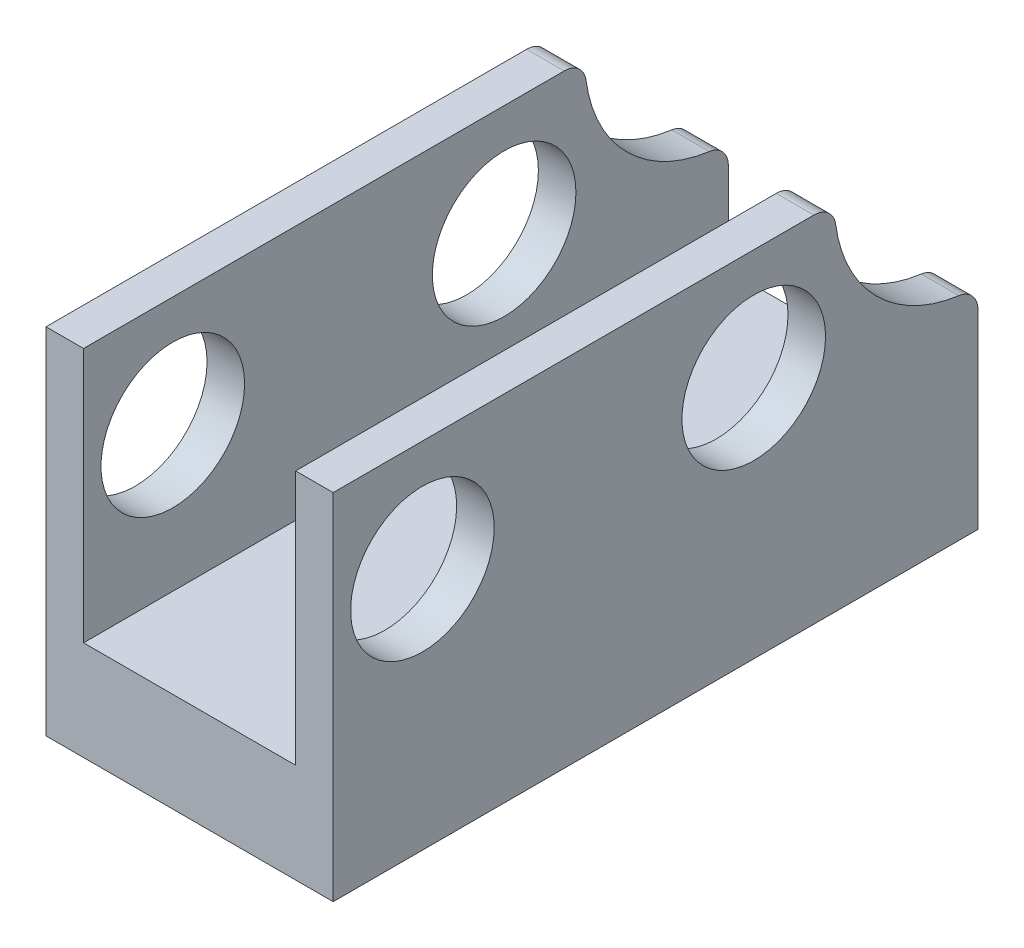
ISO-10303-21;
HEADER;
FILE_DESCRIPTION(('STEP AP214'),'2;1');
FILE_NAME('part.step','',(''),(''),'','','');
FILE_SCHEMA(('AUTOMOTIVE_DESIGN { 1 0 10303 214 1 1 1 1 }'));
ENDSEC;
DATA;
#1=APPLICATION_CONTEXT('core data for automotive mechanical design processes');
#2=APPLICATION_PROTOCOL_DEFINITION('international standard','automotive_design',2000,#1);
#3=PRODUCT_CONTEXT('',#1,'mechanical');
#4=PRODUCT('Part','Part','',(#3));
#5=PRODUCT_RELATED_PRODUCT_CATEGORY('part','',(#4));
#6=PRODUCT_DEFINITION_FORMATION('','',#4);
#7=PRODUCT_DEFINITION_CONTEXT('part definition',#1,'design');
#8=PRODUCT_DEFINITION('design','',#6,#7);
#9=PRODUCT_DEFINITION_SHAPE('','',#8);
#10=(LENGTH_UNIT() NAMED_UNIT(*) SI_UNIT(.MILLI.,.METRE.));
#11=(NAMED_UNIT(*) PLANE_ANGLE_UNIT() SI_UNIT($,.RADIAN.));
#12=(NAMED_UNIT(*) SI_UNIT($,.STERADIAN.) SOLID_ANGLE_UNIT());
#13=UNCERTAINTY_MEASURE_WITH_UNIT(LENGTH_MEASURE(1.E-05),#10,'distance_accuracy_value','');
#14=(GEOMETRIC_REPRESENTATION_CONTEXT(3) GLOBAL_UNCERTAINTY_ASSIGNED_CONTEXT((#13)) GLOBAL_UNIT_ASSIGNED_CONTEXT((#10,
#11,#12)) REPRESENTATION_CONTEXT('',''));
#15=CARTESIAN_POINT('',(0.,0.,0.));
#16=DIRECTION('',(0.,0.,1.));
#17=DIRECTION('',(1.,0.,0.));
#18=AXIS2_PLACEMENT_3D('',#15,#16,#17);
#19=CARTESIAN_POINT('',(3.25,4.01,7.297811695));
#20=DIRECTION('',(0.,0.,-1.));
#21=DIRECTION('',(-1.,0.,0.));
#22=AXIS2_PLACEMENT_3D('',#19,#20,#21);
#23=PLANE('',#22);
#24=DIRECTION('',(0.,-1.,0.));
#25=VECTOR('',#24,1.);
#26=CARTESIAN_POINT('',(-2.4,4.01,7.297811695));
#27=LINE('',#26,#25);
#28=CARTESIAN_POINT('',(-2.4,4.01,7.297811695));
#29=VERTEX_POINT('',#28);
#30=CARTESIAN_POINT('',(-2.4,-1.76,7.297811695));
#31=VERTEX_POINT('',#30);
#32=EDGE_CURVE('E162',#29,#31,#27,.T.);
#33=ORIENTED_EDGE('',*,*,#32,.F.);
#34=DIRECTION('',(-1.,0.,0.));
#35=VECTOR('',#34,1.);
#36=CARTESIAN_POINT('',(3.25,4.01,7.297811695));
#37=LINE('',#36,#35);
#38=CARTESIAN_POINT('',(-3.25,4.01,7.297811695));
#39=VERTEX_POINT('',#38);
#40=EDGE_CURVE('E214',#29,#39,#37,.T.);
#41=ORIENTED_EDGE('',*,*,#40,.T.);
#42=DIRECTION('',(0.,-1.,0.));
#43=VECTOR('',#42,1.);
#44=CARTESIAN_POINT('',(-3.25,4.01,7.297811695));
#45=LINE('',#44,#43);
#46=CARTESIAN_POINT('',(-3.25,-4.01,7.297811695));
#47=VERTEX_POINT('',#46);
#48=EDGE_CURVE('E200',#39,#47,#45,.T.);
#49=ORIENTED_EDGE('',*,*,#48,.T.);
#50=DIRECTION('',(-1.,0.,0.));
#51=VECTOR('',#50,1.);
#52=CARTESIAN_POINT('',(3.25,-4.01,7.297811695));
#53=LINE('',#52,#51);
#54=CARTESIAN_POINT('',(3.25,-4.01,7.297811695));
#55=VERTEX_POINT('',#54);
#56=EDGE_CURVE('E228',#55,#47,#53,.T.);
#57=ORIENTED_EDGE('',*,*,#56,.F.);
#58=DIRECTION('',(0.,-1.,0.));
#59=VECTOR('',#58,1.);
#60=CARTESIAN_POINT('',(3.25,4.01,7.297811695));
#61=LINE('',#60,#59);
#62=CARTESIAN_POINT('',(3.25,4.01,7.297811695));
#63=VERTEX_POINT('',#62);
#64=EDGE_CURVE('E203',#63,#55,#61,.T.);
#65=ORIENTED_EDGE('',*,*,#64,.F.);
#66=CARTESIAN_POINT('',(2.4,4.01,7.297811695));
#67=VERTEX_POINT('',#66);
#68=EDGE_CURVE('E223',#63,#67,#37,.T.);
#69=ORIENTED_EDGE('',*,*,#68,.T.);
#70=DIRECTION('',(0.,-1.,0.));
#71=VECTOR('',#70,1.);
#72=CARTESIAN_POINT('',(2.4,4.01,7.297811695));
#73=LINE('',#72,#71);
#74=CARTESIAN_POINT('',(2.4,-1.76,7.297811695));
#75=VERTEX_POINT('',#74);
#76=EDGE_CURVE('E176',#67,#75,#73,.T.);
#77=ORIENTED_EDGE('',*,*,#76,.T.);
#78=DIRECTION('',(1.,0.,0.));
#79=VECTOR('',#78,1.);
#80=CARTESIAN_POINT('',(-2.4,-1.76,7.297811695));
#81=LINE('',#80,#79);
#82=EDGE_CURVE('E154',#31,#75,#81,.T.);
#83=ORIENTED_EDGE('',*,*,#82,.F.);
#84=EDGE_LOOP('',(#33,#41,#49,#57,#65,#69,#77,#83));
#85=FACE_BOUND('',#84,.T.);
#86=ADVANCED_FACE('F48',(#85),#23,.F.);
#87=CARTESIAN_POINT('',(3.25,4.01,-7.297811695));
#88=DIRECTION('',(0.,0.,1.));
#89=DIRECTION('',(1.,0.,0.));
#90=AXIS2_PLACEMENT_3D('',#87,#88,#89);
#91=PLANE('',#90);
#92=DIRECTION('',(0.,1.,0.));
#93=VECTOR('',#92,1.);
#94=CARTESIAN_POINT('',(2.4,4.01,-7.297811695));
#95=LINE('',#94,#93);
#96=CARTESIAN_POINT('',(2.4,-1.76,-7.297811695));
#97=VERTEX_POINT('',#96);
#98=CARTESIAN_POINT('',(2.4,0.293482813170374,-7.297811695));
#99=VERTEX_POINT('',#98);
#100=EDGE_CURVE('E295',#97,#99,#95,.T.);
#101=ORIENTED_EDGE('',*,*,#100,.T.);
#102=DIRECTION('',(1.,0.,0.));
#103=VECTOR('',#102,1.);
#104=CARTESIAN_POINT('',(3.25,0.293482813170374,-7.297811695));
#105=LINE('',#104,#103);
#106=CARTESIAN_POINT('',(3.25,0.293482813170374,-7.297811695));
#107=VERTEX_POINT('',#106);
#108=EDGE_CURVE('E241',#99,#107,#105,.T.);
#109=ORIENTED_EDGE('',*,*,#108,.T.);
#110=DIRECTION('',(0.,1.,0.));
#111=VECTOR('',#110,1.);
#112=CARTESIAN_POINT('',(3.25,4.01,-7.297811695));
#113=LINE('',#112,#111);
#114=CARTESIAN_POINT('',(3.25,-4.01,-7.297811695));
#115=VERTEX_POINT('',#114);
#116=EDGE_CURVE('E209',#115,#107,#113,.T.);
#117=ORIENTED_EDGE('',*,*,#116,.F.);
#118=DIRECTION('',(-1.,0.,0.));
#119=VECTOR('',#118,1.);
#120=CARTESIAN_POINT('',(3.25,-4.01,-7.297811695));
#121=LINE('',#120,#119);
#122=CARTESIAN_POINT('',(-3.25,-4.01,-7.297811695));
#123=VERTEX_POINT('',#122);
#124=EDGE_CURVE('E225',#115,#123,#121,.T.);
#125=ORIENTED_EDGE('',*,*,#124,.T.);
#126=DIRECTION('',(0.,1.,0.));
#127=VECTOR('',#126,1.);
#128=CARTESIAN_POINT('',(-3.25,4.01,-7.297811695));
#129=LINE('',#128,#127);
#130=CARTESIAN_POINT('',(-3.25,0.293482813170374,-7.297811695));
#131=VERTEX_POINT('',#130);
#132=EDGE_CURVE('E219',#123,#131,#129,.T.);
#133=ORIENTED_EDGE('',*,*,#132,.T.);
#134=DIRECTION('',(1.,0.,0.));
#135=VECTOR('',#134,1.);
#136=CARTESIAN_POINT('',(3.25,0.293482813170374,-7.297811695));
#137=LINE('',#136,#135);
#138=CARTESIAN_POINT('',(-2.4,0.293482813170374,-7.297811695));
#139=VERTEX_POINT('',#138);
#140=EDGE_CURVE('E238',#131,#139,#137,.T.);
#141=ORIENTED_EDGE('',*,*,#140,.T.);
#142=DIRECTION('',(0.,1.,0.));
#143=VECTOR('',#142,1.);
#144=CARTESIAN_POINT('',(-2.4,4.01,-7.297811695));
#145=LINE('',#144,#143);
#146=CARTESIAN_POINT('',(-2.4,-1.76,-7.297811695));
#147=VERTEX_POINT('',#146);
#148=EDGE_CURVE('E161',#147,#139,#145,.T.);
#149=ORIENTED_EDGE('',*,*,#148,.F.);
#150=DIRECTION('',(1.,0.,0.));
#151=VECTOR('',#150,1.);
#152=CARTESIAN_POINT('',(-2.4,-1.76,-7.297811695));
#153=LINE('',#152,#151);
#154=EDGE_CURVE('E157',#147,#97,#153,.T.);
#155=ORIENTED_EDGE('',*,*,#154,.T.);
#156=EDGE_LOOP('',(#101,#109,#117,#125,#133,#141,#149,#155));
#157=FACE_BOUND('',#156,.T.);
#158=ADVANCED_FACE('F278',(#157),#91,.F.);
#159=CARTESIAN_POINT('',(3.25,4.01,7.297811695));
#160=DIRECTION('',(0.,-1.,0.));
#161=DIRECTION('',(0.,0.,-1.));
#162=AXIS2_PLACEMENT_3D('',#159,#160,#161);
#163=PLANE('',#162);
#164=DIRECTION('',(0.,0.,1.));
#165=VECTOR('',#164,1.);
#166=CARTESIAN_POINT('',(-2.4,4.01,7.297811695));
#167=LINE('',#166,#165);
#168=CARTESIAN_POINT('',(-2.4,4.01,-3.58129450817037));
#169=VERTEX_POINT('',#168);
#170=EDGE_CURVE('E167',#169,#29,#167,.T.);
#171=ORIENTED_EDGE('',*,*,#170,.F.);
#172=DIRECTION('',(1.,0.,0.));
#173=VECTOR('',#172,1.);
#174=CARTESIAN_POINT('',(3.25,4.01,-3.58129450817037));
#175=LINE('',#174,#173);
#176=CARTESIAN_POINT('',(-3.25,4.01,-3.58129450817037));
#177=VERTEX_POINT('',#176);
#178=EDGE_CURVE('E13',#169,#177,#175,.F.);
#179=ORIENTED_EDGE('',*,*,#178,.T.);
#180=DIRECTION('',(0.,0.,1.));
#181=VECTOR('',#180,1.);
#182=CARTESIAN_POINT('',(-3.25,4.01,7.297811695));
#183=LINE('',#182,#181);
#184=EDGE_CURVE('E207',#177,#39,#183,.T.);
#185=ORIENTED_EDGE('',*,*,#184,.T.);
#186=ORIENTED_EDGE('',*,*,#40,.F.);
#187=EDGE_LOOP('',(#171,#179,#185,#186));
#188=FACE_BOUND('',#187,.T.);
#189=ADVANCED_FACE('F336',(#188),#163,.F.);
#190=CARTESIAN_POINT('',(3.25,1.5,5.277811695));
#191=DIRECTION('',(-1.,0.,0.));
#192=DIRECTION('',(0.,0.,1.));
#193=AXIS2_PLACEMENT_3D('',#190,#191,#192);
#194=CYLINDRICAL_SURFACE('',#193,1.625);
#195=CARTESIAN_POINT('',(-3.25,1.5,5.277811695));
#196=DIRECTION('',(1.,0.,0.));
#197=DIRECTION('',(0.,0.,-1.));
#198=AXIS2_PLACEMENT_3D('',#195,#196,#197);
#199=CIRCLE('',#198,1.625);
#200=CARTESIAN_POINT('',(-3.25,1.5,3.652811695));
#201=VERTEX_POINT('',#200);
#202=EDGE_CURVE('E194',#201,#201,#199,.T.);
#203=ORIENTED_EDGE('',*,*,#202,.F.);
#204=EDGE_LOOP('',(#203));
#205=FACE_BOUND('',#204,.T.);
#206=CARTESIAN_POINT('',(-2.4,1.5,5.277811695));
#207=DIRECTION('',(1.,0.,0.));
#208=DIRECTION('',(0.,0.,-1.));
#209=AXIS2_PLACEMENT_3D('',#206,#207,#208);
#210=CIRCLE('',#209,1.625);
#211=CARTESIAN_POINT('',(-2.4,1.5,3.652811695));
#212=VERTEX_POINT('',#211);
#213=EDGE_CURVE('E187',#212,#212,#210,.T.);
#214=ORIENTED_EDGE('',*,*,#213,.T.);
#215=EDGE_LOOP('',(#214));
#216=FACE_BOUND('',#215,.T.);
#217=ADVANCED_FACE('F355',(#205,#216),#194,.F.);
#218=CARTESIAN_POINT('',(3.25,1.5,-2.222188305));
#219=DIRECTION('',(-1.,0.,0.));
#220=DIRECTION('',(0.,0.,1.));
#221=AXIS2_PLACEMENT_3D('',#218,#219,#220);
#222=CYLINDRICAL_SURFACE('',#221,1.625);
#223=CARTESIAN_POINT('',(-3.25,1.5,-2.222188305));
#224=DIRECTION('',(1.,0.,0.));
#225=DIRECTION('',(0.,0.,-1.));
#226=AXIS2_PLACEMENT_3D('',#223,#224,#225);
#227=CIRCLE('',#226,1.625);
#228=CARTESIAN_POINT('',(-3.25,1.5,-3.847188305));
#229=VERTEX_POINT('',#228);
#230=EDGE_CURVE('E190',#229,#229,#227,.T.);
#231=ORIENTED_EDGE('',*,*,#230,.F.);
#232=EDGE_LOOP('',(#231));
#233=FACE_BOUND('',#232,.T.);
#234=CARTESIAN_POINT('',(-2.4,1.5,-2.222188305));
#235=DIRECTION('',(1.,0.,0.));
#236=DIRECTION('',(0.,0.,-1.));
#237=AXIS2_PLACEMENT_3D('',#234,#235,#236);
#238=CIRCLE('',#237,1.625);
#239=CARTESIAN_POINT('',(-2.4,1.5,-3.847188305));
#240=VERTEX_POINT('',#239);
#241=EDGE_CURVE('E186',#240,#240,#238,.T.);
#242=ORIENTED_EDGE('',*,*,#241,.T.);
#243=EDGE_LOOP('',(#242));
#244=FACE_BOUND('',#243,.T.);
#245=ADVANCED_FACE('F350',(#233,#244),#222,.F.);
#246=CARTESIAN_POINT('',(3.25,0.,0.));
#247=DIRECTION('',(1.,0.,0.));
#248=DIRECTION('',(0.,0.,-1.));
#249=AXIS2_PLACEMENT_3D('',#246,#247,#248);
#250=PLANE('',#249);
#251=ORIENTED_EDGE('',*,*,#116,.T.);
#252=CARTESIAN_POINT('',(3.25,0.293482813170374,-6.797811695));
#253=DIRECTION('',(1.,0.,0.));
#254=DIRECTION('',(0.,0.,-1.));
#255=AXIS2_PLACEMENT_3D('',#252,#253,#254);
#256=CIRCLE('',#255,0.5);
#257=CARTESIAN_POINT('',(3.25,0.78901843808099,-6.86447836166667));
#258=VERTEX_POINT('',#257);
#259=EDGE_CURVE('E246',#107,#258,#256,.T.);
#260=ORIENTED_EDGE('',*,*,#259,.T.);
#261=CARTESIAN_POINT('',(3.25,4.01,-7.297811695));
#262=DIRECTION('',(1.,0.,0.));
#263=DIRECTION('',(0.,0.,-1.));
#264=AXIS2_PLACEMENT_3D('',#261,#262,#263);
#265=CIRCLE('',#264,3.25);
#266=CARTESIAN_POINT('',(3.25,3.57666666666667,-4.07683013308099));
#267=VERTEX_POINT('',#266);
#268=EDGE_CURVE('E289',#267,#258,#265,.T.);
#269=ORIENTED_EDGE('',*,*,#268,.F.);
#270=CARTESIAN_POINT('',(3.25,3.51,-3.58129450817037));
#271=DIRECTION('',(1.,0.,0.));
#272=DIRECTION('',(0.,0.,-1.));
#273=AXIS2_PLACEMENT_3D('',#270,#271,#272);
#274=CIRCLE('',#273,0.5);
#275=CARTESIAN_POINT('',(3.25,4.01,-3.58129450817037));
#276=VERTEX_POINT('',#275);
#277=EDGE_CURVE('E244',#267,#276,#274,.T.);
#278=ORIENTED_EDGE('',*,*,#277,.T.);
#279=DIRECTION('',(0.,0.,1.));
#280=VECTOR('',#279,1.);
#281=CARTESIAN_POINT('',(3.25,4.01,7.297811695));
#282=LINE('',#281,#280);
#283=EDGE_CURVE('E212',#276,#63,#282,.T.);
#284=ORIENTED_EDGE('',*,*,#283,.T.);
#285=ORIENTED_EDGE('',*,*,#64,.T.);
#286=DIRECTION('',(0.,0.,-1.));
#287=VECTOR('',#286,1.);
#288=CARTESIAN_POINT('',(3.25,-4.01,7.297811695));
#289=LINE('',#288,#287);
#290=EDGE_CURVE('E206',#55,#115,#289,.T.);
#291=ORIENTED_EDGE('',*,*,#290,.T.);
#292=EDGE_LOOP('',(#251,#260,#269,#278,#284,#285,#291));
#293=FACE_BOUND('',#292,.T.);
#294=CARTESIAN_POINT('',(3.25,1.5,5.277811695));
#295=DIRECTION('',(1.,0.,0.));
#296=DIRECTION('',(0.,0.,-1.));
#297=AXIS2_PLACEMENT_3D('',#294,#295,#296);
#298=CIRCLE('',#297,1.625);
#299=CARTESIAN_POINT('',(3.25,1.5,3.652811695));
#300=VERTEX_POINT('',#299);
#301=EDGE_CURVE('E197',#300,#300,#298,.T.);
#302=ORIENTED_EDGE('',*,*,#301,.F.);
#303=EDGE_LOOP('',(#302));
#304=FACE_BOUND('',#303,.T.);
#305=CARTESIAN_POINT('',(3.25,1.5,-2.222188305));
#306=DIRECTION('',(1.,0.,0.));
#307=DIRECTION('',(0.,0.,-1.));
#308=AXIS2_PLACEMENT_3D('',#305,#306,#307);
#309=CIRCLE('',#308,1.625);
#310=CARTESIAN_POINT('',(3.25,1.5,-3.847188305));
#311=VERTEX_POINT('',#310);
#312=EDGE_CURVE('E191',#311,#311,#309,.T.);
#313=ORIENTED_EDGE('',*,*,#312,.F.);
#314=EDGE_LOOP('',(#313));
#315=FACE_BOUND('',#314,.T.);
#316=ADVANCED_FACE('F308',(#293,#304,#315),#250,.T.);
#317=CARTESIAN_POINT('',(-3.25,0.,0.));
#318=DIRECTION('',(1.,0.,0.));
#319=DIRECTION('',(0.,0.,-1.));
#320=AXIS2_PLACEMENT_3D('',#317,#318,#319);
#321=PLANE('',#320);
#322=CARTESIAN_POINT('',(-3.25,4.01,-7.297811695));
#323=DIRECTION('',(1.,0.,0.));
#324=DIRECTION('',(0.,0.,-1.));
#325=AXIS2_PLACEMENT_3D('',#322,#323,#324);
#326=CIRCLE('',#325,3.25);
#327=CARTESIAN_POINT('',(-3.25,3.57666666666667,-4.07683013308099));
#328=VERTEX_POINT('',#327);
#329=CARTESIAN_POINT('',(-3.25,0.78901843808099,-6.86447836166667));
#330=VERTEX_POINT('',#329);
#331=EDGE_CURVE('E273',#328,#330,#326,.T.);
#332=ORIENTED_EDGE('',*,*,#331,.T.);
#333=CARTESIAN_POINT('',(-3.25,0.293482813170374,-6.797811695));
#334=DIRECTION('',(1.,0.,0.));
#335=DIRECTION('',(0.,0.,-1.));
#336=AXIS2_PLACEMENT_3D('',#333,#334,#335);
#337=CIRCLE('',#336,0.5);
#338=EDGE_CURVE('E56',#330,#131,#337,.F.);
#339=ORIENTED_EDGE('',*,*,#338,.T.);
#340=ORIENTED_EDGE('',*,*,#132,.F.);
#341=DIRECTION('',(0.,0.,-1.));
#342=VECTOR('',#341,1.);
#343=CARTESIAN_POINT('',(-3.25,-4.01,7.297811695));
#344=LINE('',#343,#342);
#345=EDGE_CURVE('E217',#47,#123,#344,.T.);
#346=ORIENTED_EDGE('',*,*,#345,.F.);
#347=ORIENTED_EDGE('',*,*,#48,.F.);
#348=ORIENTED_EDGE('',*,*,#184,.F.);
#349=CARTESIAN_POINT('',(-3.25,3.51,-3.58129450817037));
#350=DIRECTION('',(1.,0.,0.));
#351=DIRECTION('',(0.,0.,-1.));
#352=AXIS2_PLACEMENT_3D('',#349,#350,#351);
#353=CIRCLE('',#352,0.5);
#354=EDGE_CURVE('E267',#177,#328,#353,.F.);
#355=ORIENTED_EDGE('',*,*,#354,.T.);
#356=EDGE_LOOP('',(#332,#339,#340,#346,#347,#348,#355));
#357=FACE_BOUND('',#356,.T.);
#358=ORIENTED_EDGE('',*,*,#202,.T.);
#359=EDGE_LOOP('',(#358));
#360=FACE_BOUND('',#359,.T.);
#361=ORIENTED_EDGE('',*,*,#230,.T.);
#362=EDGE_LOOP('',(#361));
#363=FACE_BOUND('',#362,.T.);
#364=ADVANCED_FACE('F271',(#357,#360,#363),#321,.F.);
#365=CARTESIAN_POINT('',(3.25,-4.01,7.297811695));
#366=DIRECTION('',(0.,1.,0.));
#367=DIRECTION('',(0.,0.,1.));
#368=AXIS2_PLACEMENT_3D('',#365,#366,#367);
#369=PLANE('',#368);
#370=ORIENTED_EDGE('',*,*,#345,.T.);
#371=ORIENTED_EDGE('',*,*,#124,.F.);
#372=ORIENTED_EDGE('',*,*,#290,.F.);
#373=ORIENTED_EDGE('',*,*,#56,.T.);
#374=EDGE_LOOP('',(#370,#371,#372,#373));
#375=FACE_BOUND('',#374,.T.);
#376=ADVANCED_FACE('F339',(#375),#369,.F.);
#377=ORIENTED_EDGE('',*,*,#283,.F.);
#378=DIRECTION('',(1.,0.,0.));
#379=VECTOR('',#378,1.);
#380=CARTESIAN_POINT('',(3.25,4.01,-3.58129450817037));
#381=LINE('',#380,#379);
#382=CARTESIAN_POINT('',(2.4,4.01,-3.58129450817037));
#383=VERTEX_POINT('',#382);
#384=EDGE_CURVE('E257',#276,#383,#381,.F.);
#385=ORIENTED_EDGE('',*,*,#384,.T.);
#386=DIRECTION('',(0.,0.,1.));
#387=VECTOR('',#386,1.);
#388=CARTESIAN_POINT('',(2.4,4.01,7.297811695));
#389=LINE('',#388,#387);
#390=EDGE_CURVE('E171',#383,#67,#389,.T.);
#391=ORIENTED_EDGE('',*,*,#390,.T.);
#392=ORIENTED_EDGE('',*,*,#68,.F.);
#393=EDGE_LOOP('',(#377,#385,#391,#392));
#394=FACE_BOUND('',#393,.T.);
#395=ADVANCED_FACE('F300',(#394),#163,.F.);
#396=CARTESIAN_POINT('',(2.4,1.5,5.277811695));
#397=DIRECTION('',(1.,0.,0.));
#398=DIRECTION('',(0.,0.,-1.));
#399=AXIS2_PLACEMENT_3D('',#396,#397,#398);
#400=CIRCLE('',#399,1.625);
#401=CARTESIAN_POINT('',(2.4,1.5,3.652811695));
#402=VERTEX_POINT('',#401);
#403=EDGE_CURVE('E183',#402,#402,#400,.T.);
#404=ORIENTED_EDGE('',*,*,#403,.F.);
#405=EDGE_LOOP('',(#404));
#406=FACE_BOUND('',#405,.T.);
#407=ORIENTED_EDGE('',*,*,#301,.T.);
#408=EDGE_LOOP('',(#407));
#409=FACE_BOUND('',#408,.T.);
#410=ADVANCED_FACE('F345',(#406,#409),#194,.F.);
#411=CARTESIAN_POINT('',(2.4,1.5,-2.222188305));
#412=DIRECTION('',(1.,0.,0.));
#413=DIRECTION('',(0.,0.,-1.));
#414=AXIS2_PLACEMENT_3D('',#411,#412,#413);
#415=CIRCLE('',#414,1.625);
#416=CARTESIAN_POINT('',(2.4,1.5,-3.847188305));
#417=VERTEX_POINT('',#416);
#418=EDGE_CURVE('E178',#417,#417,#415,.T.);
#419=ORIENTED_EDGE('',*,*,#418,.F.);
#420=EDGE_LOOP('',(#419));
#421=FACE_BOUND('',#420,.T.);
#422=ORIENTED_EDGE('',*,*,#312,.T.);
#423=EDGE_LOOP('',(#422));
#424=FACE_BOUND('',#423,.T.);
#425=ADVANCED_FACE('F353',(#421,#424),#222,.F.);
#426=CARTESIAN_POINT('',(-2.4,-1.76,7.297811695));
#427=DIRECTION('',(0.,-1.,0.));
#428=DIRECTION('',(0.,0.,-1.));
#429=AXIS2_PLACEMENT_3D('',#426,#427,#428);
#430=PLANE('',#429);
#431=DIRECTION('',(0.,0.,-1.));
#432=VECTOR('',#431,1.);
#433=CARTESIAN_POINT('',(2.4,-1.76,7.297811695));
#434=LINE('',#433,#432);
#435=EDGE_CURVE('E287',#75,#97,#434,.T.);
#436=ORIENTED_EDGE('',*,*,#435,.T.);
#437=ORIENTED_EDGE('',*,*,#154,.F.);
#438=DIRECTION('',(0.,0.,-1.));
#439=VECTOR('',#438,1.);
#440=CARTESIAN_POINT('',(-2.4,-1.76,7.297811695));
#441=LINE('',#440,#439);
#442=EDGE_CURVE('E149',#31,#147,#441,.T.);
#443=ORIENTED_EDGE('',*,*,#442,.F.);
#444=ORIENTED_EDGE('',*,*,#82,.T.);
#445=EDGE_LOOP('',(#436,#437,#443,#444));
#446=FACE_BOUND('',#445,.T.);
#447=ADVANCED_FACE('F152',(#446),#430,.F.);
#448=CARTESIAN_POINT('',(-2.4,0.,0.));
#449=DIRECTION('',(1.,0.,0.));
#450=DIRECTION('',(0.,0.,-1.));
#451=AXIS2_PLACEMENT_3D('',#448,#449,#450);
#452=PLANE('',#451);
#453=ORIENTED_EDGE('',*,*,#148,.T.);
#454=CARTESIAN_POINT('',(-2.4,0.293482813170374,-6.797811695));
#455=DIRECTION('',(1.,0.,0.));
#456=DIRECTION('',(0.,0.,-1.));
#457=AXIS2_PLACEMENT_3D('',#454,#455,#456);
#458=CIRCLE('',#457,0.5);
#459=CARTESIAN_POINT('',(-2.4,0.78901843808099,-6.86447836166667));
#460=VERTEX_POINT('',#459);
#461=EDGE_CURVE('E261',#139,#460,#458,.T.);
#462=ORIENTED_EDGE('',*,*,#461,.T.);
#463=CARTESIAN_POINT('',(-2.4,4.01,-7.297811695));
#464=DIRECTION('',(1.,0.,0.));
#465=DIRECTION('',(0.,0.,-1.));
#466=AXIS2_PLACEMENT_3D('',#463,#464,#465);
#467=CIRCLE('',#466,3.25);
#468=CARTESIAN_POINT('',(-2.4,3.57666666666667,-4.07683013308099));
#469=VERTEX_POINT('',#468);
#470=EDGE_CURVE('E283',#469,#460,#467,.T.);
#471=ORIENTED_EDGE('',*,*,#470,.F.);
#472=CARTESIAN_POINT('',(-2.4,3.51,-3.58129450817037));
#473=DIRECTION('',(1.,0.,0.));
#474=DIRECTION('',(0.,0.,-1.));
#475=AXIS2_PLACEMENT_3D('',#472,#473,#474);
#476=CIRCLE('',#475,0.5);
#477=EDGE_CURVE('E259',#469,#169,#476,.T.);
#478=ORIENTED_EDGE('',*,*,#477,.T.);
#479=ORIENTED_EDGE('',*,*,#170,.T.);
#480=ORIENTED_EDGE('',*,*,#32,.T.);
#481=ORIENTED_EDGE('',*,*,#442,.T.);
#482=EDGE_LOOP('',(#453,#462,#471,#478,#479,#480,#481));
#483=FACE_BOUND('',#482,.T.);
#484=ORIENTED_EDGE('',*,*,#213,.F.);
#485=EDGE_LOOP('',(#484));
#486=FACE_BOUND('',#485,.T.);
#487=ORIENTED_EDGE('',*,*,#241,.F.);
#488=EDGE_LOOP('',(#487));
#489=FACE_BOUND('',#488,.T.);
#490=ADVANCED_FACE('F165',(#483,#486,#489),#452,.T.);
#491=CARTESIAN_POINT('',(2.4,0.,0.));
#492=DIRECTION('',(1.,0.,0.));
#493=DIRECTION('',(0.,0.,-1.));
#494=AXIS2_PLACEMENT_3D('',#491,#492,#493);
#495=PLANE('',#494);
#496=ORIENTED_EDGE('',*,*,#403,.T.);
#497=EDGE_LOOP('',(#496));
#498=FACE_BOUND('',#497,.T.);
#499=ORIENTED_EDGE('',*,*,#418,.T.);
#500=EDGE_LOOP('',(#499));
#501=FACE_BOUND('',#500,.T.);
#502=CARTESIAN_POINT('',(2.4,4.01,-7.297811695));
#503=DIRECTION('',(1.,0.,0.));
#504=DIRECTION('',(0.,0.,-1.));
#505=AXIS2_PLACEMENT_3D('',#502,#503,#504);
#506=CIRCLE('',#505,3.25);
#507=CARTESIAN_POINT('',(2.4,3.57666666666667,-4.07683013308099));
#508=VERTEX_POINT('',#507);
#509=CARTESIAN_POINT('',(2.4,0.78901843808099,-6.86447836166667));
#510=VERTEX_POINT('',#509);
#511=EDGE_CURVE('E231',#508,#510,#506,.T.);
#512=ORIENTED_EDGE('',*,*,#511,.T.);
#513=CARTESIAN_POINT('',(2.4,0.293482813170374,-6.797811695));
#514=DIRECTION('',(1.,0.,0.));
#515=DIRECTION('',(0.,0.,-1.));
#516=AXIS2_PLACEMENT_3D('',#513,#514,#515);
#517=CIRCLE('',#516,0.5);
#518=EDGE_CURVE('E255',#510,#99,#517,.F.);
#519=ORIENTED_EDGE('',*,*,#518,.T.);
#520=ORIENTED_EDGE('',*,*,#100,.F.);
#521=ORIENTED_EDGE('',*,*,#435,.F.);
#522=ORIENTED_EDGE('',*,*,#76,.F.);
#523=ORIENTED_EDGE('',*,*,#390,.F.);
#524=CARTESIAN_POINT('',(2.4,3.51,-3.58129450817037));
#525=DIRECTION('',(1.,0.,0.));
#526=DIRECTION('',(0.,0.,-1.));
#527=AXIS2_PLACEMENT_3D('',#524,#525,#526);
#528=CIRCLE('',#527,0.5);
#529=EDGE_CURVE('E253',#383,#508,#528,.F.);
#530=ORIENTED_EDGE('',*,*,#529,.T.);
#531=EDGE_LOOP('',(#512,#519,#520,#521,#522,#523,#530));
#532=FACE_BOUND('',#531,.T.);
#533=ADVANCED_FACE('F305',(#498,#501,#532),#495,.F.);
#534=CARTESIAN_POINT('',(-3.25,4.01,-7.297811695));
#535=DIRECTION('',(1.,0.,0.));
#536=DIRECTION('',(0.,0.,-1.));
#537=AXIS2_PLACEMENT_3D('',#534,#535,#536);
#538=CYLINDRICAL_SURFACE('',#537,3.25);
#539=ORIENTED_EDGE('',*,*,#268,.T.);
#540=DIRECTION('',(1.,0.,0.));
#541=VECTOR('',#540,1.);
#542=CARTESIAN_POINT('',(-3.25,0.78901843808099,-6.86447836166667));
#543=LINE('',#542,#541);
#544=EDGE_CURVE('E251',#258,#510,#543,.F.);
#545=ORIENTED_EDGE('',*,*,#544,.T.);
#546=ORIENTED_EDGE('',*,*,#511,.F.);
#547=DIRECTION('',(1.,0.,0.));
#548=VECTOR('',#547,1.);
#549=CARTESIAN_POINT('',(-3.25,3.57666666666667,-4.07683013308099));
#550=LINE('',#549,#548);
#551=EDGE_CURVE('E248',#508,#267,#550,.T.);
#552=ORIENTED_EDGE('',*,*,#551,.T.);
#553=EDGE_LOOP('',(#539,#545,#546,#552));
#554=FACE_BOUND('',#553,.T.);
#555=ADVANCED_FACE('F318',(#554),#538,.F.);
#556=ORIENTED_EDGE('',*,*,#470,.T.);
#557=DIRECTION('',(1.,0.,0.));
#558=VECTOR('',#557,1.);
#559=CARTESIAN_POINT('',(-3.25,0.78901843808099,-6.86447836166667));
#560=LINE('',#559,#558);
#561=EDGE_CURVE('E69',#460,#330,#560,.F.);
#562=ORIENTED_EDGE('',*,*,#561,.T.);
#563=ORIENTED_EDGE('',*,*,#331,.F.);
#564=DIRECTION('',(1.,0.,0.));
#565=VECTOR('',#564,1.);
#566=CARTESIAN_POINT('',(-3.25,3.57666666666667,-4.07683013308099));
#567=LINE('',#566,#565);
#568=EDGE_CURVE('E263',#328,#469,#567,.T.);
#569=ORIENTED_EDGE('',*,*,#568,.T.);
#570=EDGE_LOOP('',(#556,#562,#563,#569));
#571=FACE_BOUND('',#570,.T.);
#572=ADVANCED_FACE('F284',(#571),#538,.F.);
#573=CARTESIAN_POINT('',(-3.25,0.293482813170374,-6.797811695));
#574=DIRECTION('',(1.,0.,0.));
#575=DIRECTION('',(0.,0.,-1.));
#576=AXIS2_PLACEMENT_3D('',#573,#574,#575);
#577=CYLINDRICAL_SURFACE('',#576,0.5);
#578=ORIENTED_EDGE('',*,*,#518,.F.);
#579=ORIENTED_EDGE('',*,*,#544,.F.);
#580=ORIENTED_EDGE('',*,*,#259,.F.);
#581=ORIENTED_EDGE('',*,*,#108,.F.);
#582=EDGE_LOOP('',(#578,#579,#580,#581));
#583=FACE_BOUND('',#582,.T.);
#584=ADVANCED_FACE('F321',(#583),#577,.T.);
#585=CARTESIAN_POINT('',(-3.25,3.51,-3.58129450817037));
#586=DIRECTION('',(1.,0.,0.));
#587=DIRECTION('',(0.,0.,-1.));
#588=AXIS2_PLACEMENT_3D('',#585,#586,#587);
#589=CYLINDRICAL_SURFACE('',#588,0.5);
#590=ORIENTED_EDGE('',*,*,#529,.F.);
#591=ORIENTED_EDGE('',*,*,#384,.F.);
#592=ORIENTED_EDGE('',*,*,#277,.F.);
#593=ORIENTED_EDGE('',*,*,#551,.F.);
#594=EDGE_LOOP('',(#590,#591,#592,#593));
#595=FACE_BOUND('',#594,.T.);
#596=ADVANCED_FACE('F312',(#595),#589,.T.);
#597=CARTESIAN_POINT('',(-3.25,0.293482813170374,-6.797811695));
#598=DIRECTION('',(1.,0.,0.));
#599=DIRECTION('',(0.,0.,-1.));
#600=AXIS2_PLACEMENT_3D('',#597,#598,#599);
#601=CYLINDRICAL_SURFACE('',#600,0.5);
#602=ORIENTED_EDGE('',*,*,#338,.F.);
#603=ORIENTED_EDGE('',*,*,#561,.F.);
#604=ORIENTED_EDGE('',*,*,#461,.F.);
#605=ORIENTED_EDGE('',*,*,#140,.F.);
#606=EDGE_LOOP('',(#602,#603,#604,#605));
#607=FACE_BOUND('',#606,.T.);
#608=ADVANCED_FACE('F281',(#607),#601,.T.);
#609=CARTESIAN_POINT('',(-3.25,3.51,-3.58129450817037));
#610=DIRECTION('',(1.,0.,0.));
#611=DIRECTION('',(0.,0.,-1.));
#612=AXIS2_PLACEMENT_3D('',#609,#610,#611);
#613=CYLINDRICAL_SURFACE('',#612,0.5);
#614=ORIENTED_EDGE('',*,*,#354,.F.);
#615=ORIENTED_EDGE('',*,*,#178,.F.);
#616=ORIENTED_EDGE('',*,*,#477,.F.);
#617=ORIENTED_EDGE('',*,*,#568,.F.);
#618=EDGE_LOOP('',(#614,#615,#616,#617));
#619=FACE_BOUND('',#618,.T.);
#620=ADVANCED_FACE('F50',(#619),#613,.T.);
#621=CLOSED_SHELL('',(#86,#158,#189,#217,#245,#316,#364,#376,#395,#410,#425,#447,#490,#533,#555,
#572,#584,#596,#608,#620));
#622=MANIFOLD_SOLID_BREP('B2',#621);
#623=ADVANCED_BREP_SHAPE_REPRESENTATION('',(#18,#622),#14);
#624=SHAPE_DEFINITION_REPRESENTATION(#9,#623);
ENDSEC;
END-ISO-10303-21;
